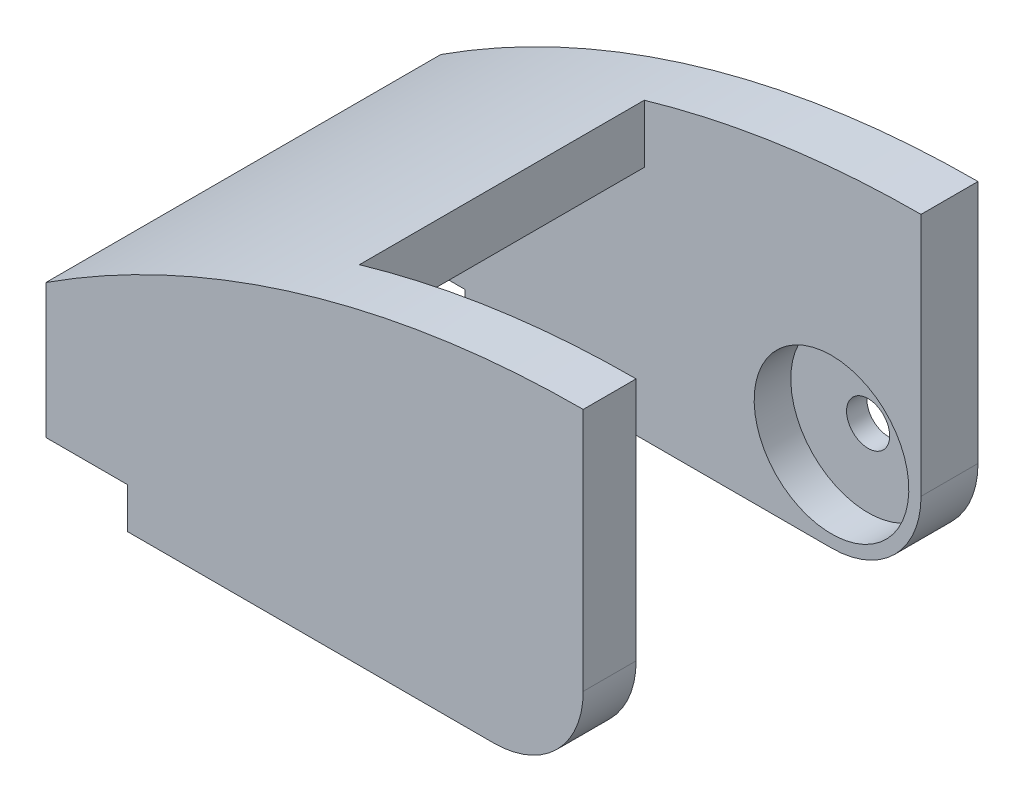
ISO-10303-21;
HEADER;
FILE_DESCRIPTION(('STEP AP214'),'2;1');
FILE_NAME('part.step','',(''),(''),'','','');
FILE_SCHEMA(('AUTOMOTIVE_DESIGN { 1 0 10303 214 1 1 1 1 }'));
ENDSEC;
DATA;
#1=APPLICATION_CONTEXT('core data for automotive mechanical design processes');
#2=APPLICATION_PROTOCOL_DEFINITION('international standard','automotive_design',2000,#1);
#3=PRODUCT_CONTEXT('',#1,'mechanical');
#4=PRODUCT('Part','Part','',(#3));
#5=PRODUCT_RELATED_PRODUCT_CATEGORY('part','',(#4));
#6=PRODUCT_DEFINITION_FORMATION('','',#4);
#7=PRODUCT_DEFINITION_CONTEXT('part definition',#1,'design');
#8=PRODUCT_DEFINITION('design','',#6,#7);
#9=PRODUCT_DEFINITION_SHAPE('','',#8);
#10=(LENGTH_UNIT() NAMED_UNIT(*) SI_UNIT(.MILLI.,.METRE.));
#11=(NAMED_UNIT(*) PLANE_ANGLE_UNIT() SI_UNIT($,.RADIAN.));
#12=(NAMED_UNIT(*) SI_UNIT($,.STERADIAN.) SOLID_ANGLE_UNIT());
#13=UNCERTAINTY_MEASURE_WITH_UNIT(LENGTH_MEASURE(1.E-05),#10,'distance_accuracy_value','');
#14=(GEOMETRIC_REPRESENTATION_CONTEXT(3) GLOBAL_UNCERTAINTY_ASSIGNED_CONTEXT((#13)) GLOBAL_UNIT_ASSIGNED_CONTEXT((#10,
#11,#12)) REPRESENTATION_CONTEXT('',''));
#15=CARTESIAN_POINT('',(0.,0.,0.));
#16=DIRECTION('',(0.,0.,1.));
#17=DIRECTION('',(1.,0.,0.));
#18=AXIS2_PLACEMENT_3D('',#15,#16,#17);
#19=CARTESIAN_POINT('',(12.,-12.,7.));
#20=DIRECTION('',(0.,0.,-1.));
#21=DIRECTION('',(0.,-1.,0.));
#22=AXIS2_PLACEMENT_3D('',#19,#20,#21);
#23=PLANE('',#22);
#24=CARTESIAN_POINT('',(0.,0.,7.));
#25=DIRECTION('',(0.,0.,-1.));
#26=DIRECTION('',(0.,1.,0.));
#27=AXIS2_PLACEMENT_3D('',#24,#25,#26);
#28=CIRCLE('',#27,9.5);
#29=CARTESIAN_POINT('',(0.,9.5,7.));
#30=VERTEX_POINT('',#29);
#31=EDGE_CURVE('E354',#30,#30,#28,.T.);
#32=ORIENTED_EDGE('',*,*,#31,.T.);
#33=EDGE_LOOP('',(#32));
#34=FACE_BOUND('',#33,.T.);
#35=DIRECTION('',(-1.,0.,0.));
#36=VECTOR('',#35,1.);
#37=CARTESIAN_POINT('',(0.,-11.,7.));
#38=LINE('',#37,#36);
#39=CARTESIAN_POINT('',(0.,-11.,7.));
#40=VERTEX_POINT('',#39);
#41=CARTESIAN_POINT('',(-45.,-11.,6.99999999999999));
#42=VERTEX_POINT('',#41);
#43=EDGE_CURVE('E292',#40,#42,#38,.T.);
#44=ORIENTED_EDGE('',*,*,#43,.F.);
#45=CARTESIAN_POINT('',(0.,0.,7.));
#46=DIRECTION('',(0.,0.,1.));
#47=DIRECTION('',(0.,-1.,0.));
#48=AXIS2_PLACEMENT_3D('',#45,#46,#47);
#49=CIRCLE('',#48,11.);
#50=CARTESIAN_POINT('',(11.,0.,7.00000000000001));
#51=VERTEX_POINT('',#50);
#52=EDGE_CURVE('E329',#40,#51,#49,.T.);
#53=ORIENTED_EDGE('',*,*,#52,.T.);
#54=DIRECTION('',(0.,-1.,0.));
#55=VECTOR('',#54,1.);
#56=CARTESIAN_POINT('',(11.,-12.,7.));
#57=LINE('',#56,#55);
#58=CARTESIAN_POINT('',(11.,30.,7.00000000000003));
#59=VERTEX_POINT('',#58);
#60=EDGE_CURVE('E337',#59,#51,#57,.T.);
#61=ORIENTED_EDGE('',*,*,#60,.F.);
#62=CARTESIAN_POINT('',(11.0000000000003,-91.4878048780494,6.99999999999999));
#63=DIRECTION('',(0.,0.,1.));
#64=DIRECTION('',(0.,-1.,0.));
#65=AXIS2_PLACEMENT_3D('',#62,#63,#64);
#66=CIRCLE('',#65,121.487804878049);
#67=CARTESIAN_POINT('',(-23.,25.1453239237065,6.99999999999999));
#68=VERTEX_POINT('',#67);
#69=EDGE_CURVE('E276',#68,#59,#66,.F.);
#70=ORIENTED_EDGE('',*,*,#69,.F.);
#71=DIRECTION('',(0.,1.,0.));
#72=VECTOR('',#71,1.);
#73=CARTESIAN_POINT('',(-23.,15.5,6.99999999999999));
#74=LINE('',#73,#72);
#75=CARTESIAN_POINT('',(-23.,18.,7.));
#76=VERTEX_POINT('',#75);
#77=EDGE_CURVE('E341',#76,#68,#74,.T.);
#78=ORIENTED_EDGE('',*,*,#77,.F.);
#79=DIRECTION('',(1.,0.,0.));
#80=VECTOR('',#79,1.);
#81=CARTESIAN_POINT('',(0.,18.,7.));
#82=LINE('',#81,#80);
#83=CARTESIAN_POINT('',(-34.2965836217796,18.,6.99999999999999));
#84=VERTEX_POINT('',#83);
#85=EDGE_CURVE('E296',#84,#76,#82,.T.);
#86=ORIENTED_EDGE('',*,*,#85,.F.);
#87=CARTESIAN_POINT('',(11.,-91.4878048780488,6.99999999999999));
#88=DIRECTION('',(0.,0.,1.));
#89=DIRECTION('',(0.,-1.,0.));
#90=AXIS2_PLACEMENT_3D('',#87,#88,#89);
#91=CIRCLE('',#90,118.487804878049);
#92=CARTESIAN_POINT('',(-54.9999999999999,6.91625959501332,6.99999999999999));
#93=VERTEX_POINT('',#92);
#94=EDGE_CURVE('E269',#84,#93,#91,.T.);
#95=ORIENTED_EDGE('',*,*,#94,.T.);
#96=DIRECTION('',(0.,-1.,0.));
#97=VECTOR('',#96,1.);
#98=CARTESIAN_POINT('',(-55.,-12.,7.));
#99=LINE('',#98,#97);
#100=CARTESIAN_POINT('',(-55.,-6.,6.99999999999999));
#101=VERTEX_POINT('',#100);
#102=EDGE_CURVE('E232',#93,#101,#99,.T.);
#103=ORIENTED_EDGE('',*,*,#102,.T.);
#104=DIRECTION('',(-1.,0.,0.));
#105=VECTOR('',#104,1.);
#106=CARTESIAN_POINT('',(12.,-6.00000000000001,7.));
#107=LINE('',#106,#105);
#108=CARTESIAN_POINT('',(-45.,-6.00000000000001,7.));
#109=VERTEX_POINT('',#108);
#110=EDGE_CURVE('E214',#109,#101,#107,.T.);
#111=ORIENTED_EDGE('',*,*,#110,.F.);
#112=DIRECTION('',(0.,1.,0.));
#113=VECTOR('',#112,1.);
#114=CARTESIAN_POINT('',(-45.,-12.,7.));
#115=LINE('',#114,#113);
#116=EDGE_CURVE('E175',#42,#109,#115,.T.);
#117=ORIENTED_EDGE('',*,*,#116,.F.);
#118=EDGE_LOOP('',(#44,#53,#61,#70,#78,#86,#95,#103,#111,#117));
#119=FACE_BOUND('',#118,.T.);
#120=ADVANCED_FACE('F49',(#34,#119),#23,.F.);
#121=CARTESIAN_POINT('',(0.,0.,0.));
#122=DIRECTION('',(0.,0.,-1.));
#123=DIRECTION('',(1.,0.,0.));
#124=AXIS2_PLACEMENT_3D('',#121,#122,#123);
#125=PLANE('',#124);
#126=DIRECTION('',(0.,-1.,0.));
#127=VECTOR('',#126,1.);
#128=CARTESIAN_POINT('',(-45.,-11.,0.));
#129=LINE('',#128,#127);
#130=CARTESIAN_POINT('',(-45.,-6.00000000000001,0.));
#131=VERTEX_POINT('',#130);
#132=CARTESIAN_POINT('',(-45.,-11.,0.));
#133=VERTEX_POINT('',#132);
#134=EDGE_CURVE('E173',#131,#133,#129,.T.);
#135=ORIENTED_EDGE('',*,*,#134,.F.);
#136=DIRECTION('',(1.,0.,0.));
#137=VECTOR('',#136,1.);
#138=CARTESIAN_POINT('',(-55.,-6.,0.));
#139=LINE('',#138,#137);
#140=CARTESIAN_POINT('',(-55.,-6.,0.));
#141=VERTEX_POINT('',#140);
#142=EDGE_CURVE('E182',#141,#131,#139,.T.);
#143=ORIENTED_EDGE('',*,*,#142,.F.);
#144=DIRECTION('',(0.,1.,0.));
#145=VECTOR('',#144,1.);
#146=CARTESIAN_POINT('',(-55.,0.,0.));
#147=LINE('',#146,#145);
#148=CARTESIAN_POINT('',(-55.,10.5086986604885,0.));
#149=VERTEX_POINT('',#148);
#150=EDGE_CURVE('E220',#141,#149,#147,.T.);
#151=ORIENTED_EDGE('',*,*,#150,.T.);
#152=CARTESIAN_POINT('',(11.,-91.4878048780488,0.));
#153=DIRECTION('',(0.,0.,1.));
#154=DIRECTION('',(1.,0.,0.));
#155=AXIS2_PLACEMENT_3D('',#152,#153,#154);
#156=CIRCLE('',#155,121.487804878049);
#157=CARTESIAN_POINT('',(11.,30.,0.));
#158=VERTEX_POINT('',#157);
#159=EDGE_CURVE('E291',#149,#158,#156,.F.);
#160=ORIENTED_EDGE('',*,*,#159,.T.);
#161=DIRECTION('',(0.,-1.,0.));
#162=VECTOR('',#161,1.);
#163=CARTESIAN_POINT('',(11.,0.,0.));
#164=LINE('',#163,#162);
#165=CARTESIAN_POINT('',(11.,0.,0.));
#166=VERTEX_POINT('',#165);
#167=EDGE_CURVE('E308',#158,#166,#164,.T.);
#168=ORIENTED_EDGE('',*,*,#167,.T.);
#169=CARTESIAN_POINT('',(0.,0.,0.));
#170=DIRECTION('',(0.,0.,1.));
#171=DIRECTION('',(1.,0.,0.));
#172=AXIS2_PLACEMENT_3D('',#169,#170,#171);
#173=CIRCLE('',#172,11.);
#174=CARTESIAN_POINT('',(0.,-11.,0.));
#175=VERTEX_POINT('',#174);
#176=EDGE_CURVE('E314',#175,#166,#173,.T.);
#177=ORIENTED_EDGE('',*,*,#176,.F.);
#178=DIRECTION('',(-1.,0.,0.));
#179=VECTOR('',#178,1.);
#180=CARTESIAN_POINT('',(0.,-11.,0.));
#181=LINE('',#180,#179);
#182=EDGE_CURVE('E194',#175,#133,#181,.T.);
#183=ORIENTED_EDGE('',*,*,#182,.T.);
#184=EDGE_LOOP('',(#135,#143,#151,#160,#168,#177,#183));
#185=FACE_BOUND('',#184,.T.);
#186=CARTESIAN_POINT('',(0.,0.,0.));
#187=DIRECTION('',(0.,0.,1.));
#188=DIRECTION('',(1.,0.,0.));
#189=AXIS2_PLACEMENT_3D('',#186,#187,#188);
#190=CIRCLE('',#189,2.65);
#191=CARTESIAN_POINT('',(2.65,0.,0.));
#192=VERTEX_POINT('',#191);
#193=EDGE_CURVE('E349',#192,#192,#190,.T.);
#194=ORIENTED_EDGE('',*,*,#193,.T.);
#195=EDGE_LOOP('',(#194));
#196=FACE_BOUND('',#195,.T.);
#197=ADVANCED_FACE('F190',(#185,#196),#125,.T.);
#198=CARTESIAN_POINT('',(0.,0.,48.5));
#199=DIRECTION('',(0.,0.,1.));
#200=DIRECTION('',(-1.,0.,0.));
#201=AXIS2_PLACEMENT_3D('',#198,#199,#200);
#202=PLANE('',#201);
#203=DIRECTION('',(0.,-1.,0.));
#204=VECTOR('',#203,1.);
#205=CARTESIAN_POINT('',(-45.,-11.,48.5));
#206=LINE('',#205,#204);
#207=CARTESIAN_POINT('',(-45.,-6.00000000000001,48.5));
#208=VERTEX_POINT('',#207);
#209=CARTESIAN_POINT('',(-45.,-11.,48.5));
#210=VERTEX_POINT('',#209);
#211=EDGE_CURVE('E187',#208,#210,#206,.T.);
#212=ORIENTED_EDGE('',*,*,#211,.T.);
#213=DIRECTION('',(-1.,0.,0.));
#214=VECTOR('',#213,1.);
#215=CARTESIAN_POINT('',(0.,-11.,48.5));
#216=LINE('',#215,#214);
#217=CARTESIAN_POINT('',(0.,-11.,48.5));
#218=VERTEX_POINT('',#217);
#219=EDGE_CURVE('E284',#218,#210,#216,.T.);
#220=ORIENTED_EDGE('',*,*,#219,.F.);
#221=CARTESIAN_POINT('',(0.,0.,48.5));
#222=DIRECTION('',(0.,0.,1.));
#223=DIRECTION('',(1.,0.,0.));
#224=AXIS2_PLACEMENT_3D('',#221,#222,#223);
#225=CIRCLE('',#224,11.);
#226=CARTESIAN_POINT('',(11.,0.,48.5));
#227=VERTEX_POINT('',#226);
#228=EDGE_CURVE('E313',#218,#227,#225,.T.);
#229=ORIENTED_EDGE('',*,*,#228,.T.);
#230=DIRECTION('',(0.,-1.,0.));
#231=VECTOR('',#230,1.);
#232=CARTESIAN_POINT('',(11.,0.,48.5));
#233=LINE('',#232,#231);
#234=CARTESIAN_POINT('',(11.,30.,48.5));
#235=VERTEX_POINT('',#234);
#236=EDGE_CURVE('E309',#235,#227,#233,.T.);
#237=ORIENTED_EDGE('',*,*,#236,.F.);
#238=CARTESIAN_POINT('',(11.,-91.4878048780488,48.5));
#239=DIRECTION('',(0.,0.,1.));
#240=DIRECTION('',(1.,0.,0.));
#241=AXIS2_PLACEMENT_3D('',#238,#239,#240);
#242=CIRCLE('',#241,121.487804878049);
#243=CARTESIAN_POINT('',(-55.,10.5086986604885,48.5));
#244=VERTEX_POINT('',#243);
#245=EDGE_CURVE('E280',#244,#235,#242,.F.);
#246=ORIENTED_EDGE('',*,*,#245,.F.);
#247=DIRECTION('',(0.,1.,0.));
#248=VECTOR('',#247,1.);
#249=CARTESIAN_POINT('',(-55.,0.,48.5));
#250=LINE('',#249,#248);
#251=CARTESIAN_POINT('',(-55.,-6.,48.5));
#252=VERTEX_POINT('',#251);
#253=EDGE_CURVE('E219',#252,#244,#250,.T.);
#254=ORIENTED_EDGE('',*,*,#253,.F.);
#255=DIRECTION('',(1.,0.,0.));
#256=VECTOR('',#255,1.);
#257=CARTESIAN_POINT('',(-55.,-6.,48.5));
#258=LINE('',#257,#256);
#259=EDGE_CURVE('E200',#252,#208,#258,.T.);
#260=ORIENTED_EDGE('',*,*,#259,.T.);
#261=EDGE_LOOP('',(#212,#220,#229,#237,#246,#254,#260));
#262=FACE_BOUND('',#261,.T.);
#263=ADVANCED_FACE('F379',(#262),#202,.T.);
#264=CARTESIAN_POINT('',(11.,-91.4878048780488,7.));
#265=DIRECTION('',(0.,0.,-1.));
#266=DIRECTION('',(1.,0.,0.));
#267=AXIS2_PLACEMENT_3D('',#264,#265,#266);
#268=CYLINDRICAL_SURFACE('',#267,121.487804878049);
#269=DIRECTION('',(0.,0.,1.));
#270=VECTOR('',#269,1.);
#271=CARTESIAN_POINT('',(-55.,10.5086986604885,0.));
#272=LINE('',#271,#270);
#273=EDGE_CURVE('E223',#149,#244,#272,.T.);
#274=ORIENTED_EDGE('',*,*,#273,.T.);
#275=ORIENTED_EDGE('',*,*,#245,.T.);
#276=DIRECTION('',(0.,0.,-1.));
#277=VECTOR('',#276,1.);
#278=CARTESIAN_POINT('',(11.,30.,48.5));
#279=LINE('',#278,#277);
#280=CARTESIAN_POINT('',(11.,30.,42.));
#281=VERTEX_POINT('',#280);
#282=EDGE_CURVE('E325',#235,#281,#279,.T.);
#283=ORIENTED_EDGE('',*,*,#282,.T.);
#284=CARTESIAN_POINT('',(11.0000000000003,-91.4878048780494,42.));
#285=DIRECTION('',(0.,0.,1.));
#286=DIRECTION('',(1.,0.,0.));
#287=AXIS2_PLACEMENT_3D('',#284,#285,#286);
#288=CIRCLE('',#287,121.487804878049);
#289=CARTESIAN_POINT('',(-23.,25.1453239237065,42.));
#290=VERTEX_POINT('',#289);
#291=EDGE_CURVE('E239',#281,#290,#288,.T.);
#292=ORIENTED_EDGE('',*,*,#291,.T.);
#293=DIRECTION('',(0.,0.,-1.));
#294=VECTOR('',#293,1.);
#295=CARTESIAN_POINT('',(-23.,25.1453239237065,48.5));
#296=LINE('',#295,#294);
#297=EDGE_CURVE('E273',#290,#68,#296,.T.);
#298=ORIENTED_EDGE('',*,*,#297,.T.);
#299=ORIENTED_EDGE('',*,*,#69,.T.);
#300=EDGE_CURVE('E330',#59,#158,#279,.T.);
#301=ORIENTED_EDGE('',*,*,#300,.T.);
#302=ORIENTED_EDGE('',*,*,#159,.F.);
#303=EDGE_LOOP('',(#274,#275,#283,#292,#298,#299,#301,#302));
#304=FACE_BOUND('',#303,.T.);
#305=ADVANCED_FACE('F382',(#304),#268,.T.);
#306=CARTESIAN_POINT('',(0.,-11.,7.));
#307=DIRECTION('',(0.,1.,0.));
#308=DIRECTION('',(-1.,0.,0.));
#309=AXIS2_PLACEMENT_3D('',#306,#307,#308);
#310=PLANE('',#309);
#311=DIRECTION('',(1.,0.,0.));
#312=VECTOR('',#311,1.);
#313=CARTESIAN_POINT('',(0.,-11.,42.));
#314=LINE('',#313,#312);
#315=CARTESIAN_POINT('',(-45.,-11.,42.));
#316=VERTEX_POINT('',#315);
#317=CARTESIAN_POINT('',(0.,-11.,42.));
#318=VERTEX_POINT('',#317);
#319=EDGE_CURVE('E254',#316,#318,#314,.T.);
#320=ORIENTED_EDGE('',*,*,#319,.T.);
#321=DIRECTION('',(0.,0.,1.));
#322=VECTOR('',#321,1.);
#323=CARTESIAN_POINT('',(0.,-11.,41.5));
#324=LINE('',#323,#322);
#325=EDGE_CURVE('E288',#318,#218,#324,.T.);
#326=ORIENTED_EDGE('',*,*,#325,.T.);
#327=ORIENTED_EDGE('',*,*,#219,.T.);
#328=DIRECTION('',(0.,0.,1.));
#329=VECTOR('',#328,1.);
#330=CARTESIAN_POINT('',(-45.,-11.,0.));
#331=LINE('',#330,#329);
#332=EDGE_CURVE('E178',#316,#210,#331,.T.);
#333=ORIENTED_EDGE('',*,*,#332,.F.);
#334=EDGE_LOOP('',(#320,#326,#327,#333));
#335=FACE_BOUND('',#334,.T.);
#336=ADVANCED_FACE('F412',(#335),#310,.F.);
#337=ORIENTED_EDGE('',*,*,#182,.F.);
#338=DIRECTION('',(0.,0.,-1.));
#339=VECTOR('',#338,1.);
#340=CARTESIAN_POINT('',(0.,-11.,7.));
#341=LINE('',#340,#339);
#342=EDGE_CURVE('E300',#40,#175,#341,.T.);
#343=ORIENTED_EDGE('',*,*,#342,.F.);
#344=ORIENTED_EDGE('',*,*,#43,.T.);
#345=EDGE_CURVE('E207',#133,#42,#331,.T.);
#346=ORIENTED_EDGE('',*,*,#345,.F.);
#347=EDGE_LOOP('',(#337,#343,#344,#346));
#348=FACE_BOUND('',#347,.T.);
#349=ADVANCED_FACE('F395',(#348),#310,.F.);
#350=CARTESIAN_POINT('',(11.,-91.4878048780488,41.5));
#351=DIRECTION('',(0.,0.,-1.));
#352=DIRECTION('',(1.,0.,0.));
#353=AXIS2_PLACEMENT_3D('',#350,#351,#352);
#354=CYLINDRICAL_SURFACE('',#353,118.487804878049);
#355=DIRECTION('',(0.,0.,-1.));
#356=VECTOR('',#355,1.);
#357=CARTESIAN_POINT('',(-54.9999999999999,6.91625959501332,41.5));
#358=LINE('',#357,#356);
#359=CARTESIAN_POINT('',(-55.,6.91625959501332,42.));
#360=VERTEX_POINT('',#359);
#361=EDGE_CURVE('E229',#360,#93,#358,.T.);
#362=ORIENTED_EDGE('',*,*,#361,.T.);
#363=ORIENTED_EDGE('',*,*,#94,.F.);
#364=DIRECTION('',(0.,0.,-1.));
#365=VECTOR('',#364,1.);
#366=CARTESIAN_POINT('',(-34.2965836217796,18.,41.5));
#367=LINE('',#366,#365);
#368=CARTESIAN_POINT('',(-34.2965836217796,18.,42.));
#369=VERTEX_POINT('',#368);
#370=EDGE_CURVE('E266',#369,#84,#367,.T.);
#371=ORIENTED_EDGE('',*,*,#370,.F.);
#372=CARTESIAN_POINT('',(11.,-91.4878048780488,42.));
#373=DIRECTION('',(0.,0.,1.));
#374=DIRECTION('',(1.,0.,0.));
#375=AXIS2_PLACEMENT_3D('',#372,#373,#374);
#376=CIRCLE('',#375,118.487804878049);
#377=EDGE_CURVE('E250',#369,#360,#376,.T.);
#378=ORIENTED_EDGE('',*,*,#377,.T.);
#379=EDGE_LOOP('',(#362,#363,#371,#378));
#380=FACE_BOUND('',#379,.T.);
#381=ADVANCED_FACE('F400',(#380),#354,.F.);
#382=CARTESIAN_POINT('',(0.,0.,42.));
#383=DIRECTION('',(0.,0.,-1.));
#384=DIRECTION('',(1.,0.,0.));
#385=AXIS2_PLACEMENT_3D('',#382,#383,#384);
#386=PLANE('',#385);
#387=DIRECTION('',(0.,1.,0.));
#388=VECTOR('',#387,1.);
#389=CARTESIAN_POINT('',(-45.,0.,42.));
#390=LINE('',#389,#388);
#391=CARTESIAN_POINT('',(-45.,-6.00000000000001,42.));
#392=VERTEX_POINT('',#391);
#393=EDGE_CURVE('E11',#316,#392,#390,.T.);
#394=ORIENTED_EDGE('',*,*,#393,.T.);
#395=DIRECTION('',(-1.,0.,0.));
#396=VECTOR('',#395,1.);
#397=CARTESIAN_POINT('',(0.,-6.00000000000001,42.));
#398=LINE('',#397,#396);
#399=CARTESIAN_POINT('',(-55.,-6.,42.));
#400=VERTEX_POINT('',#399);
#401=EDGE_CURVE('E209',#392,#400,#398,.T.);
#402=ORIENTED_EDGE('',*,*,#401,.T.);
#403=DIRECTION('',(0.,-1.,0.));
#404=VECTOR('',#403,1.);
#405=CARTESIAN_POINT('',(-55.,0.,42.));
#406=LINE('',#405,#404);
#407=EDGE_CURVE('E368',#360,#400,#406,.T.);
#408=ORIENTED_EDGE('',*,*,#407,.F.);
#409=ORIENTED_EDGE('',*,*,#377,.F.);
#410=DIRECTION('',(-1.,0.,0.));
#411=VECTOR('',#410,1.);
#412=CARTESIAN_POINT('',(0.,18.,42.));
#413=LINE('',#412,#411);
#414=CARTESIAN_POINT('',(-23.,18.,42.));
#415=VERTEX_POINT('',#414);
#416=EDGE_CURVE('E247',#415,#369,#413,.T.);
#417=ORIENTED_EDGE('',*,*,#416,.F.);
#418=DIRECTION('',(0.,-1.,0.));
#419=VECTOR('',#418,1.);
#420=CARTESIAN_POINT('',(-23.,0.,42.));
#421=LINE('',#420,#419);
#422=EDGE_CURVE('E243',#290,#415,#421,.T.);
#423=ORIENTED_EDGE('',*,*,#422,.F.);
#424=ORIENTED_EDGE('',*,*,#291,.F.);
#425=DIRECTION('',(0.,1.,0.));
#426=VECTOR('',#425,1.);
#427=CARTESIAN_POINT('',(11.,0.,42.));
#428=LINE('',#427,#426);
#429=CARTESIAN_POINT('',(11.,0.,42.));
#430=VERTEX_POINT('',#429);
#431=EDGE_CURVE('E236',#430,#281,#428,.T.);
#432=ORIENTED_EDGE('',*,*,#431,.F.);
#433=CARTESIAN_POINT('',(0.,0.,42.));
#434=DIRECTION('',(0.,0.,1.));
#435=DIRECTION('',(1.,0.,0.));
#436=AXIS2_PLACEMENT_3D('',#433,#434,#435);
#437=CIRCLE('',#436,11.);
#438=EDGE_CURVE('E258',#318,#430,#437,.T.);
#439=ORIENTED_EDGE('',*,*,#438,.F.);
#440=ORIENTED_EDGE('',*,*,#319,.F.);
#441=EDGE_LOOP('',(#394,#402,#408,#409,#417,#423,#424,#432,#439,#440));
#442=FACE_BOUND('',#441,.T.);
#443=CARTESIAN_POINT('',(0.,0.,42.));
#444=DIRECTION('',(0.,0.,1.));
#445=DIRECTION('',(1.,0.,0.));
#446=AXIS2_PLACEMENT_3D('',#443,#444,#445);
#447=CIRCLE('',#446,4.2);
#448=CARTESIAN_POINT('',(4.2,0.,42.));
#449=VERTEX_POINT('',#448);
#450=EDGE_CURVE('E262',#449,#449,#447,.F.);
#451=ORIENTED_EDGE('',*,*,#450,.F.);
#452=EDGE_LOOP('',(#451));
#453=FACE_BOUND('',#452,.T.);
#454=ADVANCED_FACE('F405',(#442,#453),#386,.T.);
#455=CARTESIAN_POINT('',(0.,0.,48.5));
#456=DIRECTION('',(0.,0.,-1.));
#457=DIRECTION('',(1.,0.,0.));
#458=AXIS2_PLACEMENT_3D('',#455,#456,#457);
#459=CYLINDRICAL_SURFACE('',#458,11.);
#460=DIRECTION('',(0.,0.,-1.));
#461=VECTOR('',#460,1.);
#462=CARTESIAN_POINT('',(11.,0.,48.5));
#463=LINE('',#462,#461);
#464=EDGE_CURVE('E331',#227,#430,#463,.T.);
#465=ORIENTED_EDGE('',*,*,#464,.F.);
#466=ORIENTED_EDGE('',*,*,#228,.F.);
#467=ORIENTED_EDGE('',*,*,#325,.F.);
#468=ORIENTED_EDGE('',*,*,#438,.T.);
#469=EDGE_LOOP('',(#465,#466,#467,#468));
#470=FACE_BOUND('',#469,.T.);
#471=ADVANCED_FACE('F432',(#470),#459,.T.);
#472=CARTESIAN_POINT('',(11.,0.,48.5));
#473=DIRECTION('',(-1.,0.,0.));
#474=DIRECTION('',(0.,0.,-1.));
#475=AXIS2_PLACEMENT_3D('',#472,#473,#474);
#476=PLANE('',#475);
#477=ORIENTED_EDGE('',*,*,#431,.T.);
#478=ORIENTED_EDGE('',*,*,#282,.F.);
#479=ORIENTED_EDGE('',*,*,#236,.T.);
#480=ORIENTED_EDGE('',*,*,#464,.T.);
#481=EDGE_LOOP('',(#477,#478,#479,#480));
#482=FACE_BOUND('',#481,.T.);
#483=ADVANCED_FACE('F425',(#482),#476,.F.);
#484=CARTESIAN_POINT('',(12.,18.,7.));
#485=DIRECTION('',(0.,1.,0.));
#486=DIRECTION('',(0.,0.,-1.));
#487=AXIS2_PLACEMENT_3D('',#484,#485,#486);
#488=PLANE('',#487);
#489=ORIENTED_EDGE('',*,*,#370,.T.);
#490=ORIENTED_EDGE('',*,*,#85,.T.);
#491=DIRECTION('',(0.,0.,-1.));
#492=VECTOR('',#491,1.);
#493=CARTESIAN_POINT('',(-23.,18.,6.99999999999999));
#494=LINE('',#493,#492);
#495=EDGE_CURVE('E362',#415,#76,#494,.T.);
#496=ORIENTED_EDGE('',*,*,#495,.F.);
#497=ORIENTED_EDGE('',*,*,#416,.T.);
#498=EDGE_LOOP('',(#489,#490,#496,#497));
#499=FACE_BOUND('',#498,.T.);
#500=ADVANCED_FACE('F423',(#499),#488,.F.);
#501=ORIENTED_EDGE('',*,*,#176,.T.);
#502=EDGE_CURVE('E318',#51,#166,#463,.T.);
#503=ORIENTED_EDGE('',*,*,#502,.F.);
#504=ORIENTED_EDGE('',*,*,#52,.F.);
#505=ORIENTED_EDGE('',*,*,#342,.T.);
#506=EDGE_LOOP('',(#501,#503,#504,#505));
#507=FACE_BOUND('',#506,.T.);
#508=ADVANCED_FACE('F392',(#507),#459,.T.);
#509=CARTESIAN_POINT('',(0.,0.,48.));
#510=DIRECTION('',(0.,0.,-1.));
#511=DIRECTION('',(1.,0.,0.));
#512=AXIS2_PLACEMENT_3D('',#509,#510,#511);
#513=CYLINDRICAL_SURFACE('',#512,2.65);
#514=ORIENTED_EDGE('',*,*,#193,.F.);
#515=EDGE_LOOP('',(#514));
#516=FACE_BOUND('',#515,.T.);
#517=CARTESIAN_POINT('',(0.,0.,2.5));
#518=DIRECTION('',(0.,0.,-1.));
#519=DIRECTION('',(0.,1.,0.));
#520=AXIS2_PLACEMENT_3D('',#517,#518,#519);
#521=CIRCLE('',#520,2.65);
#522=CARTESIAN_POINT('',(0.,2.65,2.5));
#523=VERTEX_POINT('',#522);
#524=EDGE_CURVE('E350',#523,#523,#521,.F.);
#525=ORIENTED_EDGE('',*,*,#524,.T.);
#526=EDGE_LOOP('',(#525));
#527=FACE_BOUND('',#526,.T.);
#528=ADVANCED_FACE('F51',(#516,#527),#513,.F.);
#529=CARTESIAN_POINT('',(0.,0.,2.5));
#530=DIRECTION('',(0.,0.,1.));
#531=DIRECTION('',(0.,1.,0.));
#532=AXIS2_PLACEMENT_3D('',#529,#530,#531);
#533=PLANE('',#532);
#534=CARTESIAN_POINT('',(0.,0.,2.5));
#535=DIRECTION('',(0.,0.,-1.));
#536=DIRECTION('',(0.,1.,0.));
#537=AXIS2_PLACEMENT_3D('',#534,#535,#536);
#538=CIRCLE('',#537,9.5);
#539=CARTESIAN_POINT('',(0.,9.5,2.5));
#540=VERTEX_POINT('',#539);
#541=EDGE_CURVE('E355',#540,#540,#538,.T.);
#542=ORIENTED_EDGE('',*,*,#541,.F.);
#543=EDGE_LOOP('',(#542));
#544=FACE_BOUND('',#543,.T.);
#545=ORIENTED_EDGE('',*,*,#524,.F.);
#546=EDGE_LOOP('',(#545));
#547=FACE_BOUND('',#546,.T.);
#548=ADVANCED_FACE('F535',(#544,#547),#533,.T.);
#549=CARTESIAN_POINT('',(0.,0.,2.5));
#550=DIRECTION('',(0.,0.,1.));
#551=DIRECTION('',(0.,1.,0.));
#552=AXIS2_PLACEMENT_3D('',#549,#550,#551);
#553=CYLINDRICAL_SURFACE('',#552,9.5);
#554=ORIENTED_EDGE('',*,*,#541,.T.);
#555=EDGE_LOOP('',(#554));
#556=FACE_BOUND('',#555,.T.);
#557=ORIENTED_EDGE('',*,*,#31,.F.);
#558=EDGE_LOOP('',(#557));
#559=FACE_BOUND('',#558,.T.);
#560=ADVANCED_FACE('F454',(#556,#559),#553,.F.);
#561=CARTESIAN_POINT('',(-23.,15.5,41.));
#562=DIRECTION('',(-1.,0.,0.));
#563=DIRECTION('',(0.,0.,-1.));
#564=AXIS2_PLACEMENT_3D('',#561,#562,#563);
#565=PLANE('',#564);
#566=ORIENTED_EDGE('',*,*,#297,.F.);
#567=ORIENTED_EDGE('',*,*,#422,.T.);
#568=ORIENTED_EDGE('',*,*,#495,.T.);
#569=ORIENTED_EDGE('',*,*,#77,.T.);
#570=EDGE_LOOP('',(#566,#567,#568,#569));
#571=FACE_BOUND('',#570,.T.);
#572=ADVANCED_FACE('F421',(#571),#565,.F.);
#573=ORIENTED_EDGE('',*,*,#300,.F.);
#574=ORIENTED_EDGE('',*,*,#60,.T.);
#575=ORIENTED_EDGE('',*,*,#502,.T.);
#576=ORIENTED_EDGE('',*,*,#167,.F.);
#577=EDGE_LOOP('',(#573,#574,#575,#576));
#578=FACE_BOUND('',#577,.T.);
#579=ADVANCED_FACE('F387',(#578),#476,.F.);
#580=CARTESIAN_POINT('',(0.,0.,37.5));
#581=DIRECTION('',(0.,0.,-1.));
#582=DIRECTION('',(1.,0.,0.));
#583=AXIS2_PLACEMENT_3D('',#580,#581,#582);
#584=PLANE('',#583);
#585=CARTESIAN_POINT('',(0.,0.,37.5));
#586=DIRECTION('',(0.,0.,1.));
#587=DIRECTION('',(1.,0.,0.));
#588=AXIS2_PLACEMENT_3D('',#585,#586,#587);
#589=CIRCLE('',#588,4.2);
#590=CARTESIAN_POINT('',(4.2,0.,37.5));
#591=VERTEX_POINT('',#590);
#592=EDGE_CURVE('E345',#591,#591,#589,.T.);
#593=ORIENTED_EDGE('',*,*,#592,.F.);
#594=EDGE_LOOP('',(#593));
#595=FACE_BOUND('',#594,.T.);
#596=ADVANCED_FACE('F447',(#595),#584,.T.);
#597=CARTESIAN_POINT('',(0.,0.,37.5));
#598=DIRECTION('',(0.,0.,1.));
#599=DIRECTION('',(-1.,0.,0.));
#600=AXIS2_PLACEMENT_3D('',#597,#598,#599);
#601=CYLINDRICAL_SURFACE('',#600,4.2);
#602=ORIENTED_EDGE('',*,*,#592,.T.);
#603=EDGE_LOOP('',(#602));
#604=FACE_BOUND('',#603,.T.);
#605=ORIENTED_EDGE('',*,*,#450,.T.);
#606=EDGE_LOOP('',(#605));
#607=FACE_BOUND('',#606,.T.);
#608=ADVANCED_FACE('F444',(#604,#607),#601,.T.);
#609=CARTESIAN_POINT('',(-55.,0.,0.));
#610=DIRECTION('',(-1.,0.,0.));
#611=DIRECTION('',(0.,-1.,0.));
#612=AXIS2_PLACEMENT_3D('',#609,#610,#611);
#613=PLANE('',#612);
#614=DIRECTION('',(0.,0.,1.));
#615=VECTOR('',#614,1.);
#616=CARTESIAN_POINT('',(-55.,-6.,0.));
#617=LINE('',#616,#615);
#618=EDGE_CURVE('E72',#141,#101,#617,.T.);
#619=ORIENTED_EDGE('',*,*,#618,.T.);
#620=ORIENTED_EDGE('',*,*,#102,.F.);
#621=ORIENTED_EDGE('',*,*,#361,.F.);
#622=ORIENTED_EDGE('',*,*,#407,.T.);
#623=DIRECTION('',(0.,0.,1.));
#624=VECTOR('',#623,1.);
#625=CARTESIAN_POINT('',(-55.,-6.,0.));
#626=LINE('',#625,#624);
#627=EDGE_CURVE('E58',#400,#252,#626,.T.);
#628=ORIENTED_EDGE('',*,*,#627,.T.);
#629=ORIENTED_EDGE('',*,*,#253,.T.);
#630=ORIENTED_EDGE('',*,*,#273,.F.);
#631=ORIENTED_EDGE('',*,*,#150,.F.);
#632=EDGE_LOOP('',(#619,#620,#621,#622,#628,#629,#630,#631));
#633=FACE_BOUND('',#632,.T.);
#634=ADVANCED_FACE('F372',(#633),#613,.T.);
#635=CARTESIAN_POINT('',(-55.,-6.,0.));
#636=DIRECTION('',(0.,1.,0.));
#637=DIRECTION('',(-1.,0.,0.));
#638=AXIS2_PLACEMENT_3D('',#635,#636,#637);
#639=PLANE('',#638);
#640=ORIENTED_EDGE('',*,*,#401,.F.);
#641=DIRECTION('',(0.,0.,1.));
#642=VECTOR('',#641,1.);
#643=CARTESIAN_POINT('',(-45.,-6.00000000000001,0.));
#644=LINE('',#643,#642);
#645=EDGE_CURVE('E179',#392,#208,#644,.T.);
#646=ORIENTED_EDGE('',*,*,#645,.T.);
#647=ORIENTED_EDGE('',*,*,#259,.F.);
#648=ORIENTED_EDGE('',*,*,#627,.F.);
#649=EDGE_LOOP('',(#640,#646,#647,#648));
#650=FACE_BOUND('',#649,.T.);
#651=ADVANCED_FACE('F376',(#650),#639,.F.);
#652=CARTESIAN_POINT('',(-45.,-11.,0.));
#653=DIRECTION('',(1.,0.,0.));
#654=DIRECTION('',(0.,0.,1.));
#655=AXIS2_PLACEMENT_3D('',#652,#653,#654);
#656=PLANE('',#655);
#657=ORIENTED_EDGE('',*,*,#393,.F.);
#658=ORIENTED_EDGE('',*,*,#332,.T.);
#659=ORIENTED_EDGE('',*,*,#211,.F.);
#660=ORIENTED_EDGE('',*,*,#645,.F.);
#661=EDGE_LOOP('',(#657,#658,#659,#660));
#662=FACE_BOUND('',#661,.T.);
#663=ADVANCED_FACE('F410',(#662),#656,.F.);
#664=ORIENTED_EDGE('',*,*,#345,.T.);
#665=ORIENTED_EDGE('',*,*,#116,.T.);
#666=EDGE_CURVE('E170',#131,#109,#644,.T.);
#667=ORIENTED_EDGE('',*,*,#666,.F.);
#668=ORIENTED_EDGE('',*,*,#134,.T.);
#669=EDGE_LOOP('',(#664,#665,#667,#668));
#670=FACE_BOUND('',#669,.T.);
#671=ADVANCED_FACE('F171',(#670),#656,.F.);
#672=ORIENTED_EDGE('',*,*,#666,.T.);
#673=ORIENTED_EDGE('',*,*,#110,.T.);
#674=ORIENTED_EDGE('',*,*,#618,.F.);
#675=ORIENTED_EDGE('',*,*,#142,.T.);
#676=EDGE_LOOP('',(#672,#673,#674,#675));
#677=FACE_BOUND('',#676,.T.);
#678=ADVANCED_FACE('F183',(#677),#639,.F.);
#679=CLOSED_SHELL('',(#120,#197,#263,#305,#336,#349,#381,#454,#471,#483,#500,#508,#528,#548,
#560,#572,#579,#596,#608,#634,#651,#663,#671,#678));
#680=MANIFOLD_SOLID_BREP('B2',#679);
#681=ADVANCED_BREP_SHAPE_REPRESENTATION('',(#18,#680),#14);
#682=SHAPE_DEFINITION_REPRESENTATION(#9,#681);
ENDSEC;
END-ISO-10303-21;
